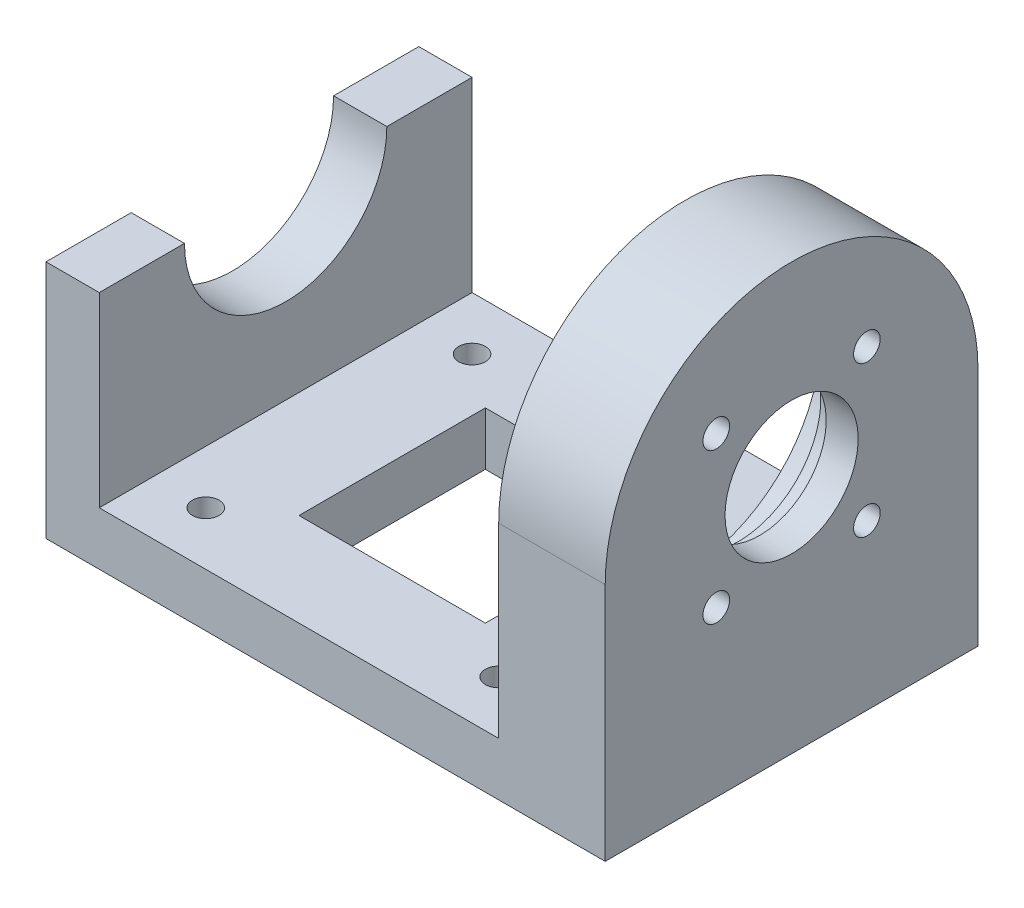
ISO-10303-21;
HEADER;
FILE_DESCRIPTION(('STEP AP214'),'2;1');
FILE_NAME('part.step','',(''),(''),'','','');
FILE_SCHEMA(('AUTOMOTIVE_DESIGN { 1 0 10303 214 1 1 1 1 }'));
ENDSEC;
DATA;
#1=APPLICATION_CONTEXT('core data for automotive mechanical design processes');
#2=APPLICATION_PROTOCOL_DEFINITION('international standard','automotive_design',2000,#1);
#3=PRODUCT_CONTEXT('',#1,'mechanical');
#4=PRODUCT('Part','Part','',(#3));
#5=PRODUCT_RELATED_PRODUCT_CATEGORY('part','',(#4));
#6=PRODUCT_DEFINITION_FORMATION('','',#4);
#7=PRODUCT_DEFINITION_CONTEXT('part definition',#1,'design');
#8=PRODUCT_DEFINITION('design','',#6,#7);
#9=PRODUCT_DEFINITION_SHAPE('','',#8);
#10=(LENGTH_UNIT() NAMED_UNIT(*) SI_UNIT(.MILLI.,.METRE.));
#11=(NAMED_UNIT(*) PLANE_ANGLE_UNIT() SI_UNIT($,.RADIAN.));
#12=(NAMED_UNIT(*) SI_UNIT($,.STERADIAN.) SOLID_ANGLE_UNIT());
#13=UNCERTAINTY_MEASURE_WITH_UNIT(LENGTH_MEASURE(1.E-05),#10,'distance_accuracy_value','');
#14=(GEOMETRIC_REPRESENTATION_CONTEXT(3) GLOBAL_UNCERTAINTY_ASSIGNED_CONTEXT((#13)) GLOBAL_UNIT_ASSIGNED_CONTEXT((#10,
#11,#12)) REPRESENTATION_CONTEXT('',''));
#15=CARTESIAN_POINT('',(0.,0.,0.));
#16=DIRECTION('',(0.,0.,1.));
#17=DIRECTION('',(1.,0.,0.));
#18=AXIS2_PLACEMENT_3D('',#15,#16,#17);
#19=CARTESIAN_POINT('',(0.,45.,0.));
#20=DIRECTION('',(0.,1.,0.));
#21=DIRECTION('',(0.,0.,1.));
#22=AXIS2_PLACEMENT_3D('',#19,#20,#21);
#23=PLANE('',#22);
#24=DIRECTION('',(-1.,0.,0.));
#25=VECTOR('',#24,1.);
#26=CARTESIAN_POINT('',(-42.5,45.,-19.));
#27=LINE('',#26,#25);
#28=CARTESIAN_POINT('',(-42.5,45.,-19.));
#29=VERTEX_POINT('',#28);
#30=CARTESIAN_POINT('',(-52.5,45.,-19.));
#31=VERTEX_POINT('',#30);
#32=EDGE_CURVE('E11',#29,#31,#27,.T.);
#33=ORIENTED_EDGE('',*,*,#32,.F.);
#34=DIRECTION('',(0.,0.,-1.));
#35=VECTOR('',#34,1.);
#36=CARTESIAN_POINT('',(-42.5,45.,-35.));
#37=LINE('',#36,#35);
#38=CARTESIAN_POINT('',(-42.5,45.,-35.));
#39=VERTEX_POINT('',#38);
#40=EDGE_CURVE('E212',#29,#39,#37,.T.);
#41=ORIENTED_EDGE('',*,*,#40,.T.);
#42=DIRECTION('',(-1.,0.,0.));
#43=VECTOR('',#42,1.);
#44=CARTESIAN_POINT('',(-52.5,45.,-35.));
#45=LINE('',#44,#43);
#46=CARTESIAN_POINT('',(-52.5,45.,-35.));
#47=VERTEX_POINT('',#46);
#48=EDGE_CURVE('E216',#39,#47,#45,.T.);
#49=ORIENTED_EDGE('',*,*,#48,.T.);
#50=DIRECTION('',(0.,0.,1.));
#51=VECTOR('',#50,1.);
#52=CARTESIAN_POINT('',(-52.5,45.,-35.));
#53=LINE('',#52,#51);
#54=EDGE_CURVE('E206',#47,#31,#53,.T.);
#55=ORIENTED_EDGE('',*,*,#54,.T.);
#56=EDGE_LOOP('',(#33,#41,#49,#55));
#57=FACE_BOUND('',#56,.T.);
#58=ADVANCED_FACE('F34',(#57),#23,.T.);
#59=CARTESIAN_POINT('',(0.,10.,0.));
#60=DIRECTION('',(0.,-1.,0.));
#61=DIRECTION('',(0.,0.,-1.));
#62=AXIS2_PLACEMENT_3D('',#59,#60,#61);
#63=PLANE('',#62);
#64=DIRECTION('',(-1.,0.,0.));
#65=VECTOR('',#64,1.);
#66=CARTESIAN_POINT('',(-22.5,10.,-17.5));
#67=LINE('',#66,#65);
#68=CARTESIAN_POINT('',(12.5,10.,-17.5));
#69=VERTEX_POINT('',#68);
#70=CARTESIAN_POINT('',(-22.5,10.,-17.5));
#71=VERTEX_POINT('',#70);
#72=EDGE_CURVE('E161',#69,#71,#67,.T.);
#73=ORIENTED_EDGE('',*,*,#72,.F.);
#74=DIRECTION('',(0.,0.,-1.));
#75=VECTOR('',#74,1.);
#76=CARTESIAN_POINT('',(12.5,10.,17.5));
#77=LINE('',#76,#75);
#78=CARTESIAN_POINT('',(12.5,10.,17.5));
#79=VERTEX_POINT('',#78);
#80=EDGE_CURVE('E49',#79,#69,#77,.T.);
#81=ORIENTED_EDGE('',*,*,#80,.F.);
#82=DIRECTION('',(1.,0.,0.));
#83=VECTOR('',#82,1.);
#84=CARTESIAN_POINT('',(-22.5,10.,17.5));
#85=LINE('',#84,#83);
#86=CARTESIAN_POINT('',(-22.5,10.,17.5));
#87=VERTEX_POINT('',#86);
#88=EDGE_CURVE('E152',#87,#79,#85,.T.);
#89=ORIENTED_EDGE('',*,*,#88,.F.);
#90=DIRECTION('',(0.,0.,1.));
#91=VECTOR('',#90,1.);
#92=CARTESIAN_POINT('',(-22.5,10.,17.5));
#93=LINE('',#92,#91);
#94=EDGE_CURVE('E155',#71,#87,#93,.T.);
#95=ORIENTED_EDGE('',*,*,#94,.F.);
#96=EDGE_LOOP('',(#73,#81,#89,#95));
#97=FACE_BOUND('',#96,.T.);
#98=CARTESIAN_POINT('',(22.5,10.,-25.));
#99=DIRECTION('',(0.,1.,0.));
#100=DIRECTION('',(0.,0.,1.));
#101=AXIS2_PLACEMENT_3D('',#98,#99,#100);
#102=CIRCLE('',#101,2.5);
#103=CARTESIAN_POINT('',(22.5,10.,-22.5));
#104=VERTEX_POINT('',#103);
#105=EDGE_CURVE('E181',#104,#104,#102,.T.);
#106=ORIENTED_EDGE('',*,*,#105,.F.);
#107=EDGE_LOOP('',(#106));
#108=FACE_BOUND('',#107,.T.);
#109=CARTESIAN_POINT('',(22.5,10.,25.));
#110=DIRECTION('',(0.,1.,0.));
#111=DIRECTION('',(0.,0.,1.));
#112=AXIS2_PLACEMENT_3D('',#109,#110,#111);
#113=CIRCLE('',#112,2.5);
#114=CARTESIAN_POINT('',(22.5,10.,27.5));
#115=VERTEX_POINT('',#114);
#116=EDGE_CURVE('E187',#115,#115,#113,.T.);
#117=ORIENTED_EDGE('',*,*,#116,.F.);
#118=EDGE_LOOP('',(#117));
#119=FACE_BOUND('',#118,.T.);
#120=CARTESIAN_POINT('',(-32.5,10.,25.));
#121=DIRECTION('',(0.,1.,0.));
#122=DIRECTION('',(0.,0.,1.));
#123=AXIS2_PLACEMENT_3D('',#120,#121,#122);
#124=CIRCLE('',#123,2.5);
#125=CARTESIAN_POINT('',(-32.5,10.,27.5));
#126=VERTEX_POINT('',#125);
#127=EDGE_CURVE('E176',#126,#126,#124,.T.);
#128=ORIENTED_EDGE('',*,*,#127,.F.);
#129=EDGE_LOOP('',(#128));
#130=FACE_BOUND('',#129,.T.);
#131=CARTESIAN_POINT('',(-32.5,10.,-25.));
#132=DIRECTION('',(0.,1.,0.));
#133=DIRECTION('',(0.,0.,1.));
#134=AXIS2_PLACEMENT_3D('',#131,#132,#133);
#135=CIRCLE('',#134,2.5);
#136=CARTESIAN_POINT('',(-32.5,10.,-22.5));
#137=VERTEX_POINT('',#136);
#138=EDGE_CURVE('E180',#137,#137,#135,.T.);
#139=ORIENTED_EDGE('',*,*,#138,.F.);
#140=EDGE_LOOP('',(#139));
#141=FACE_BOUND('',#140,.T.);
#142=DIRECTION('',(0.,0.,-1.));
#143=VECTOR('',#142,1.);
#144=CARTESIAN_POINT('',(-42.5,10.,-35.));
#145=LINE('',#144,#143);
#146=CARTESIAN_POINT('',(-42.5,10.,35.));
#147=VERTEX_POINT('',#146);
#148=CARTESIAN_POINT('',(-42.5,10.,-35.));
#149=VERTEX_POINT('',#148);
#150=EDGE_CURVE('E204',#147,#149,#145,.T.);
#151=ORIENTED_EDGE('',*,*,#150,.F.);
#152=DIRECTION('',(1.,0.,0.));
#153=VECTOR('',#152,1.);
#154=CARTESIAN_POINT('',(-52.5,10.,35.));
#155=LINE('',#154,#153);
#156=CARTESIAN_POINT('',(32.5,10.,35.));
#157=VERTEX_POINT('',#156);
#158=EDGE_CURVE('E284',#147,#157,#155,.T.);
#159=ORIENTED_EDGE('',*,*,#158,.T.);
#160=DIRECTION('',(0.,0.,1.));
#161=VECTOR('',#160,1.);
#162=CARTESIAN_POINT('',(32.5,10.,-35.));
#163=LINE('',#162,#161);
#164=CARTESIAN_POINT('',(32.5,10.,-35.));
#165=VERTEX_POINT('',#164);
#166=EDGE_CURVE('E273',#165,#157,#163,.T.);
#167=ORIENTED_EDGE('',*,*,#166,.F.);
#168=DIRECTION('',(-1.,0.,0.));
#169=VECTOR('',#168,1.);
#170=CARTESIAN_POINT('',(-52.5,10.,-35.));
#171=LINE('',#170,#169);
#172=EDGE_CURVE('E282',#165,#149,#171,.T.);
#173=ORIENTED_EDGE('',*,*,#172,.T.);
#174=EDGE_LOOP('',(#151,#159,#167,#173));
#175=FACE_BOUND('',#174,.T.);
#176=ADVANCED_FACE('F348',(#97,#108,#119,#130,#141,#175),#63,.F.);
#177=CARTESIAN_POINT('',(52.5,10.,35.));
#178=DIRECTION('',(-1.,0.,0.));
#179=DIRECTION('',(0.,0.,1.));
#180=AXIS2_PLACEMENT_3D('',#177,#178,#179);
#181=PLANE('',#180);
#182=CARTESIAN_POINT('',(52.5,45.,0.));
#183=DIRECTION('',(-1.,0.,0.));
#184=DIRECTION('',(0.,0.,1.));
#185=AXIS2_PLACEMENT_3D('',#182,#183,#184);
#186=CIRCLE('',#185,12.5);
#187=CARTESIAN_POINT('',(52.5,45.,12.5));
#188=VERTEX_POINT('',#187);
#189=EDGE_CURVE('E173',#188,#188,#186,.T.);
#190=ORIENTED_EDGE('',*,*,#189,.T.);
#191=EDGE_LOOP('',(#190));
#192=FACE_BOUND('',#191,.T.);
#193=CARTESIAN_POINT('',(52.5,30.857864376269,14.1421356237313));
#194=DIRECTION('',(-1.,0.,0.));
#195=DIRECTION('',(0.,0.,1.));
#196=AXIS2_PLACEMENT_3D('',#193,#194,#195);
#197=CIRCLE('',#196,2.5);
#198=CARTESIAN_POINT('',(52.5,30.857864376269,16.6421356237313));
#199=VERTEX_POINT('',#198);
#200=EDGE_CURVE('E231',#199,#199,#197,.F.);
#201=ORIENTED_EDGE('',*,*,#200,.F.);
#202=EDGE_LOOP('',(#201));
#203=FACE_BOUND('',#202,.T.);
#204=CARTESIAN_POINT('',(52.5,30.8578643762688,-14.1421356237307));
#205=DIRECTION('',(-1.,0.,0.));
#206=DIRECTION('',(0.,0.,1.));
#207=AXIS2_PLACEMENT_3D('',#204,#205,#206);
#208=CIRCLE('',#207,2.5);
#209=CARTESIAN_POINT('',(52.5,30.8578643762688,-11.6421356237307));
#210=VERTEX_POINT('',#209);
#211=EDGE_CURVE('E232',#210,#210,#208,.F.);
#212=ORIENTED_EDGE('',*,*,#211,.F.);
#213=EDGE_LOOP('',(#212));
#214=FACE_BOUND('',#213,.T.);
#215=CARTESIAN_POINT('',(52.5,59.1421356237307,-14.1421356237308));
#216=DIRECTION('',(-1.,0.,0.));
#217=DIRECTION('',(0.,0.,1.));
#218=AXIS2_PLACEMENT_3D('',#215,#216,#217);
#219=CIRCLE('',#218,2.5);
#220=CARTESIAN_POINT('',(52.5,59.1421356237307,-11.6421356237308));
#221=VERTEX_POINT('',#220);
#222=EDGE_CURVE('E239',#221,#221,#219,.F.);
#223=ORIENTED_EDGE('',*,*,#222,.F.);
#224=EDGE_LOOP('',(#223));
#225=FACE_BOUND('',#224,.T.);
#226=CARTESIAN_POINT('',(52.5,59.1421356237309,14.142135623731));
#227=DIRECTION('',(-1.,0.,0.));
#228=DIRECTION('',(0.,0.,1.));
#229=AXIS2_PLACEMENT_3D('',#226,#227,#228);
#230=CIRCLE('',#229,2.5);
#231=CARTESIAN_POINT('',(52.5,59.1421356237309,16.642135623731));
#232=VERTEX_POINT('',#231);
#233=EDGE_CURVE('E248',#232,#232,#230,.F.);
#234=ORIENTED_EDGE('',*,*,#233,.F.);
#235=EDGE_LOOP('',(#234));
#236=FACE_BOUND('',#235,.T.);
#237=CARTESIAN_POINT('',(52.5,45.,0.));
#238=DIRECTION('',(-1.,0.,0.));
#239=DIRECTION('',(0.,0.,1.));
#240=AXIS2_PLACEMENT_3D('',#237,#238,#239);
#241=CIRCLE('',#240,35.);
#242=CARTESIAN_POINT('',(52.5,45.,35.));
#243=VERTEX_POINT('',#242);
#244=CARTESIAN_POINT('',(52.5,45.,-35.));
#245=VERTEX_POINT('',#244);
#246=EDGE_CURVE('E267',#243,#245,#241,.T.);
#247=ORIENTED_EDGE('',*,*,#246,.F.);
#248=DIRECTION('',(0.,-1.,0.));
#249=VECTOR('',#248,1.);
#250=CARTESIAN_POINT('',(52.5,10.,35.));
#251=LINE('',#250,#249);
#252=CARTESIAN_POINT('',(52.5,0.,35.));
#253=VERTEX_POINT('',#252);
#254=EDGE_CURVE('E287',#243,#253,#251,.T.);
#255=ORIENTED_EDGE('',*,*,#254,.T.);
#256=DIRECTION('',(0.,0.,-1.));
#257=VECTOR('',#256,1.);
#258=CARTESIAN_POINT('',(52.5,0.,35.));
#259=LINE('',#258,#257);
#260=CARTESIAN_POINT('',(52.5,0.,-35.));
#261=VERTEX_POINT('',#260);
#262=EDGE_CURVE('E281',#253,#261,#259,.T.);
#263=ORIENTED_EDGE('',*,*,#262,.T.);
#264=DIRECTION('',(0.,-1.,0.));
#265=VECTOR('',#264,1.);
#266=CARTESIAN_POINT('',(52.5,10.,-35.));
#267=LINE('',#266,#265);
#268=EDGE_CURVE('E303',#245,#261,#267,.T.);
#269=ORIENTED_EDGE('',*,*,#268,.F.);
#270=EDGE_LOOP('',(#247,#255,#263,#269));
#271=FACE_BOUND('',#270,.T.);
#272=ADVANCED_FACE('F36',(#192,#203,#214,#225,#236,#271),#181,.F.);
#273=CARTESIAN_POINT('',(32.5,80.,-35.));
#274=DIRECTION('',(1.,0.,0.));
#275=DIRECTION('',(0.,0.,-1.));
#276=AXIS2_PLACEMENT_3D('',#273,#274,#275);
#277=PLANE('',#276);
#278=CARTESIAN_POINT('',(32.5,45.,0.));
#279=DIRECTION('',(-1.,0.,0.));
#280=DIRECTION('',(0.,0.,1.));
#281=AXIS2_PLACEMENT_3D('',#278,#279,#280);
#282=CIRCLE('',#281,25.5);
#283=CARTESIAN_POINT('',(32.5,45.,25.5));
#284=VERTEX_POINT('',#283);
#285=EDGE_CURVE('E255',#284,#284,#282,.T.);
#286=ORIENTED_EDGE('',*,*,#285,.F.);
#287=EDGE_LOOP('',(#286));
#288=FACE_BOUND('',#287,.T.);
#289=DIRECTION('',(0.,-1.,0.));
#290=VECTOR('',#289,1.);
#291=CARTESIAN_POINT('',(32.5,80.,35.));
#292=LINE('',#291,#290);
#293=CARTESIAN_POINT('',(32.5,45.,35.));
#294=VERTEX_POINT('',#293);
#295=EDGE_CURVE('E276',#294,#157,#292,.T.);
#296=ORIENTED_EDGE('',*,*,#295,.F.);
#297=CARTESIAN_POINT('',(32.5,45.,0.));
#298=DIRECTION('',(-1.,0.,0.));
#299=DIRECTION('',(0.,0.,1.));
#300=AXIS2_PLACEMENT_3D('',#297,#298,#299);
#301=CIRCLE('',#300,35.);
#302=CARTESIAN_POINT('',(32.5,45.,-35.));
#303=VERTEX_POINT('',#302);
#304=EDGE_CURVE('E266',#294,#303,#301,.T.);
#305=ORIENTED_EDGE('',*,*,#304,.T.);
#306=DIRECTION('',(0.,-1.,0.));
#307=VECTOR('',#306,1.);
#308=CARTESIAN_POINT('',(32.5,80.,-35.));
#309=LINE('',#308,#307);
#310=EDGE_CURVE('E279',#303,#165,#309,.T.);
#311=ORIENTED_EDGE('',*,*,#310,.T.);
#312=ORIENTED_EDGE('',*,*,#166,.T.);
#313=EDGE_LOOP('',(#296,#305,#311,#312));
#314=FACE_BOUND('',#313,.T.);
#315=ADVANCED_FACE('F346',(#288,#314),#277,.F.);
#316=CARTESIAN_POINT('',(-52.5,10.,-35.));
#317=DIRECTION('',(0.,0.,1.));
#318=DIRECTION('',(1.,0.,0.));
#319=AXIS2_PLACEMENT_3D('',#316,#317,#318);
#320=PLANE('',#319);
#321=DIRECTION('',(-1.,0.,0.));
#322=VECTOR('',#321,1.);
#323=CARTESIAN_POINT('',(52.5,45.,-35.));
#324=LINE('',#323,#322);
#325=EDGE_CURVE('E269',#245,#303,#324,.T.);
#326=ORIENTED_EDGE('',*,*,#325,.F.);
#327=ORIENTED_EDGE('',*,*,#268,.T.);
#328=DIRECTION('',(-1.,0.,0.));
#329=VECTOR('',#328,1.);
#330=CARTESIAN_POINT('',(-52.5,0.,-35.));
#331=LINE('',#330,#329);
#332=CARTESIAN_POINT('',(-52.5,0.,-35.));
#333=VERTEX_POINT('',#332);
#334=EDGE_CURVE('E290',#261,#333,#331,.T.);
#335=ORIENTED_EDGE('',*,*,#334,.T.);
#336=DIRECTION('',(0.,-1.,0.));
#337=VECTOR('',#336,1.);
#338=CARTESIAN_POINT('',(-52.5,10.,-35.));
#339=LINE('',#338,#337);
#340=EDGE_CURVE('E300',#47,#333,#339,.T.);
#341=ORIENTED_EDGE('',*,*,#340,.F.);
#342=ORIENTED_EDGE('',*,*,#48,.F.);
#343=DIRECTION('',(0.,-1.,0.));
#344=VECTOR('',#343,1.);
#345=CARTESIAN_POINT('',(-42.5,45.,-35.));
#346=LINE('',#345,#344);
#347=EDGE_CURVE('E219',#39,#149,#346,.T.);
#348=ORIENTED_EDGE('',*,*,#347,.T.);
#349=ORIENTED_EDGE('',*,*,#172,.F.);
#350=ORIENTED_EDGE('',*,*,#310,.F.);
#351=EDGE_LOOP('',(#326,#327,#335,#341,#342,#348,#349,#350));
#352=FACE_BOUND('',#351,.T.);
#353=ADVANCED_FACE('F329',(#352),#320,.F.);
#354=CARTESIAN_POINT('',(-52.5,10.,35.));
#355=DIRECTION('',(1.,0.,0.));
#356=DIRECTION('',(0.,0.,-1.));
#357=AXIS2_PLACEMENT_3D('',#354,#355,#356);
#358=PLANE('',#357);
#359=CARTESIAN_POINT('',(-52.5,45.,19.));
#360=VERTEX_POINT('',#359);
#361=CARTESIAN_POINT('',(-52.5,45.,35.));
#362=VERTEX_POINT('',#361);
#363=EDGE_CURVE('E210',#360,#362,#53,.T.);
#364=ORIENTED_EDGE('',*,*,#363,.F.);
#365=CARTESIAN_POINT('',(-52.5,45.,0.));
#366=DIRECTION('',(-1.,0.,0.));
#367=DIRECTION('',(0.,0.,1.));
#368=AXIS2_PLACEMENT_3D('',#365,#366,#367);
#369=CIRCLE('',#368,19.);
#370=EDGE_CURVE('E198',#31,#360,#369,.T.);
#371=ORIENTED_EDGE('',*,*,#370,.F.);
#372=ORIENTED_EDGE('',*,*,#54,.F.);
#373=ORIENTED_EDGE('',*,*,#340,.T.);
#374=DIRECTION('',(0.,0.,1.));
#375=VECTOR('',#374,1.);
#376=CARTESIAN_POINT('',(-52.5,0.,35.));
#377=LINE('',#376,#375);
#378=CARTESIAN_POINT('',(-52.5,0.,35.));
#379=VERTEX_POINT('',#378);
#380=EDGE_CURVE('E292',#333,#379,#377,.T.);
#381=ORIENTED_EDGE('',*,*,#380,.T.);
#382=DIRECTION('',(0.,-1.,0.));
#383=VECTOR('',#382,1.);
#384=CARTESIAN_POINT('',(-52.5,10.,35.));
#385=LINE('',#384,#383);
#386=EDGE_CURVE('E297',#362,#379,#385,.T.);
#387=ORIENTED_EDGE('',*,*,#386,.F.);
#388=EDGE_LOOP('',(#364,#371,#372,#373,#381,#387));
#389=FACE_BOUND('',#388,.T.);
#390=ADVANCED_FACE('F334',(#389),#358,.F.);
#391=CARTESIAN_POINT('',(-52.5,10.,35.));
#392=DIRECTION('',(0.,0.,-1.));
#393=DIRECTION('',(-1.,0.,0.));
#394=AXIS2_PLACEMENT_3D('',#391,#392,#393);
#395=PLANE('',#394);
#396=ORIENTED_EDGE('',*,*,#254,.F.);
#397=DIRECTION('',(-1.,0.,0.));
#398=VECTOR('',#397,1.);
#399=CARTESIAN_POINT('',(52.5,45.,35.));
#400=LINE('',#399,#398);
#401=EDGE_CURVE('E261',#243,#294,#400,.T.);
#402=ORIENTED_EDGE('',*,*,#401,.T.);
#403=ORIENTED_EDGE('',*,*,#295,.T.);
#404=ORIENTED_EDGE('',*,*,#158,.F.);
#405=DIRECTION('',(0.,-1.,0.));
#406=VECTOR('',#405,1.);
#407=CARTESIAN_POINT('',(-42.5,45.,35.));
#408=LINE('',#407,#406);
#409=CARTESIAN_POINT('',(-42.5,45.,35.));
#410=VERTEX_POINT('',#409);
#411=EDGE_CURVE('E224',#410,#147,#408,.T.);
#412=ORIENTED_EDGE('',*,*,#411,.F.);
#413=DIRECTION('',(1.,0.,0.));
#414=VECTOR('',#413,1.);
#415=CARTESIAN_POINT('',(-52.5,45.,35.));
#416=LINE('',#415,#414);
#417=EDGE_CURVE('E209',#362,#410,#416,.T.);
#418=ORIENTED_EDGE('',*,*,#417,.F.);
#419=ORIENTED_EDGE('',*,*,#386,.T.);
#420=DIRECTION('',(1.,0.,0.));
#421=VECTOR('',#420,1.);
#422=CARTESIAN_POINT('',(-52.5,0.,35.));
#423=LINE('',#422,#421);
#424=EDGE_CURVE('E285',#379,#253,#423,.T.);
#425=ORIENTED_EDGE('',*,*,#424,.T.);
#426=EDGE_LOOP('',(#396,#402,#403,#404,#412,#418,#419,#425));
#427=FACE_BOUND('',#426,.T.);
#428=ADVANCED_FACE('F322',(#427),#395,.F.);
#429=CARTESIAN_POINT('',(0.,0.,0.));
#430=DIRECTION('',(0.,-1.,0.));
#431=DIRECTION('',(0.,0.,-1.));
#432=AXIS2_PLACEMENT_3D('',#429,#430,#431);
#433=PLANE('',#432);
#434=DIRECTION('',(0.,0.,-1.));
#435=VECTOR('',#434,1.);
#436=CARTESIAN_POINT('',(12.5,0.,17.5));
#437=LINE('',#436,#435);
#438=CARTESIAN_POINT('',(12.5,0.,17.5));
#439=VERTEX_POINT('',#438);
#440=CARTESIAN_POINT('',(12.5,0.,-17.5));
#441=VERTEX_POINT('',#440);
#442=EDGE_CURVE('E136',#439,#441,#437,.T.);
#443=ORIENTED_EDGE('',*,*,#442,.T.);
#444=DIRECTION('',(-1.,0.,0.));
#445=VECTOR('',#444,1.);
#446=CARTESIAN_POINT('',(-22.5,0.,-17.5));
#447=LINE('',#446,#445);
#448=CARTESIAN_POINT('',(-22.5,0.,-17.5));
#449=VERTEX_POINT('',#448);
#450=EDGE_CURVE('E145',#441,#449,#447,.T.);
#451=ORIENTED_EDGE('',*,*,#450,.T.);
#452=DIRECTION('',(0.,0.,1.));
#453=VECTOR('',#452,1.);
#454=CARTESIAN_POINT('',(-22.5,0.,17.5));
#455=LINE('',#454,#453);
#456=CARTESIAN_POINT('',(-22.5,0.,17.5));
#457=VERTEX_POINT('',#456);
#458=EDGE_CURVE('E57',#449,#457,#455,.T.);
#459=ORIENTED_EDGE('',*,*,#458,.T.);
#460=DIRECTION('',(1.,0.,0.));
#461=VECTOR('',#460,1.);
#462=CARTESIAN_POINT('',(-22.5,0.,17.5));
#463=LINE('',#462,#461);
#464=EDGE_CURVE('E142',#457,#439,#463,.T.);
#465=ORIENTED_EDGE('',*,*,#464,.T.);
#466=EDGE_LOOP('',(#443,#451,#459,#465));
#467=FACE_BOUND('',#466,.T.);
#468=CARTESIAN_POINT('',(22.5,0.,-25.));
#469=DIRECTION('',(0.,1.,0.));
#470=DIRECTION('',(0.,0.,1.));
#471=AXIS2_PLACEMENT_3D('',#468,#469,#470);
#472=CIRCLE('',#471,2.5);
#473=CARTESIAN_POINT('',(22.5,0.,-22.5));
#474=VERTEX_POINT('',#473);
#475=EDGE_CURVE('E177',#474,#474,#472,.T.);
#476=ORIENTED_EDGE('',*,*,#475,.T.);
#477=EDGE_LOOP('',(#476));
#478=FACE_BOUND('',#477,.T.);
#479=CARTESIAN_POINT('',(22.5,0.,25.));
#480=DIRECTION('',(0.,1.,0.));
#481=DIRECTION('',(0.,0.,1.));
#482=AXIS2_PLACEMENT_3D('',#479,#480,#481);
#483=CIRCLE('',#482,2.5);
#484=CARTESIAN_POINT('',(22.5,0.,27.5));
#485=VERTEX_POINT('',#484);
#486=EDGE_CURVE('E184',#485,#485,#483,.T.);
#487=ORIENTED_EDGE('',*,*,#486,.T.);
#488=EDGE_LOOP('',(#487));
#489=FACE_BOUND('',#488,.T.);
#490=CARTESIAN_POINT('',(-32.5,0.,25.));
#491=DIRECTION('',(0.,1.,0.));
#492=DIRECTION('',(0.,0.,1.));
#493=AXIS2_PLACEMENT_3D('',#490,#491,#492);
#494=CIRCLE('',#493,2.5);
#495=CARTESIAN_POINT('',(-32.5,0.,27.5));
#496=VERTEX_POINT('',#495);
#497=EDGE_CURVE('E190',#496,#496,#494,.T.);
#498=ORIENTED_EDGE('',*,*,#497,.T.);
#499=EDGE_LOOP('',(#498));
#500=FACE_BOUND('',#499,.T.);
#501=CARTESIAN_POINT('',(-32.5,0.,-25.));
#502=DIRECTION('',(0.,1.,0.));
#503=DIRECTION('',(0.,0.,1.));
#504=AXIS2_PLACEMENT_3D('',#501,#502,#503);
#505=CIRCLE('',#504,2.5);
#506=CARTESIAN_POINT('',(-32.5,0.,-22.5));
#507=VERTEX_POINT('',#506);
#508=EDGE_CURVE('E195',#507,#507,#505,.T.);
#509=ORIENTED_EDGE('',*,*,#508,.T.);
#510=EDGE_LOOP('',(#509));
#511=FACE_BOUND('',#510,.T.);
#512=ORIENTED_EDGE('',*,*,#262,.F.);
#513=ORIENTED_EDGE('',*,*,#424,.F.);
#514=ORIENTED_EDGE('',*,*,#380,.F.);
#515=ORIENTED_EDGE('',*,*,#334,.F.);
#516=EDGE_LOOP('',(#512,#513,#514,#515));
#517=FACE_BOUND('',#516,.T.);
#518=ADVANCED_FACE('F149',(#467,#478,#489,#500,#511,#517),#433,.T.);
#519=CARTESIAN_POINT('',(52.5,45.,0.));
#520=DIRECTION('',(-1.,0.,0.));
#521=DIRECTION('',(0.,0.,1.));
#522=AXIS2_PLACEMENT_3D('',#519,#520,#521);
#523=CYLINDRICAL_SURFACE('',#522,35.);
#524=ORIENTED_EDGE('',*,*,#304,.F.);
#525=ORIENTED_EDGE('',*,*,#401,.F.);
#526=ORIENTED_EDGE('',*,*,#246,.T.);
#527=ORIENTED_EDGE('',*,*,#325,.T.);
#528=EDGE_LOOP('',(#524,#525,#526,#527));
#529=FACE_BOUND('',#528,.T.);
#530=ADVANCED_FACE('F364',(#529),#523,.T.);
#531=CARTESIAN_POINT('',(42.5,45.,0.));
#532=DIRECTION('',(-1.,0.,0.));
#533=DIRECTION('',(0.,0.,1.));
#534=AXIS2_PLACEMENT_3D('',#531,#532,#533);
#535=CYLINDRICAL_SURFACE('',#534,25.5);
#536=CARTESIAN_POINT('',(42.5,45.,0.));
#537=DIRECTION('',(-1.,0.,0.));
#538=DIRECTION('',(0.,0.,1.));
#539=AXIS2_PLACEMENT_3D('',#536,#537,#538);
#540=CIRCLE('',#539,25.5);
#541=CARTESIAN_POINT('',(42.5,45.,25.5));
#542=VERTEX_POINT('',#541);
#543=EDGE_CURVE('E258',#542,#542,#540,.T.);
#544=ORIENTED_EDGE('',*,*,#543,.F.);
#545=EDGE_LOOP('',(#544));
#546=FACE_BOUND('',#545,.T.);
#547=ORIENTED_EDGE('',*,*,#285,.T.);
#548=EDGE_LOOP('',(#547));
#549=FACE_BOUND('',#548,.T.);
#550=ADVANCED_FACE('F377',(#546,#549),#535,.F.);
#551=CARTESIAN_POINT('',(42.5,45.,0.));
#552=DIRECTION('',(-1.,0.,0.));
#553=DIRECTION('',(0.,0.,1.));
#554=AXIS2_PLACEMENT_3D('',#551,#552,#553);
#555=PLANE('',#554);
#556=CARTESIAN_POINT('',(42.5,30.857864376269,14.1421356237313));
#557=DIRECTION('',(-1.,0.,0.));
#558=DIRECTION('',(0.,0.,1.));
#559=AXIS2_PLACEMENT_3D('',#556,#557,#558);
#560=CIRCLE('',#559,2.5);
#561=CARTESIAN_POINT('',(42.5,30.857864376269,16.6421356237313));
#562=VERTEX_POINT('',#561);
#563=EDGE_CURVE('E228',#562,#562,#560,.T.);
#564=ORIENTED_EDGE('',*,*,#563,.F.);
#565=EDGE_LOOP('',(#564));
#566=FACE_BOUND('',#565,.T.);
#567=CARTESIAN_POINT('',(42.5,30.8578643762688,-14.1421356237307));
#568=DIRECTION('',(-1.,0.,0.));
#569=DIRECTION('',(0.,0.,1.));
#570=AXIS2_PLACEMENT_3D('',#567,#568,#569);
#571=CIRCLE('',#570,2.5);
#572=CARTESIAN_POINT('',(42.5,30.8578643762688,-11.6421356237307));
#573=VERTEX_POINT('',#572);
#574=EDGE_CURVE('E236',#573,#573,#571,.T.);
#575=ORIENTED_EDGE('',*,*,#574,.F.);
#576=EDGE_LOOP('',(#575));
#577=FACE_BOUND('',#576,.T.);
#578=CARTESIAN_POINT('',(42.5,59.1421356237307,-14.1421356237308));
#579=DIRECTION('',(-1.,0.,0.));
#580=DIRECTION('',(0.,0.,1.));
#581=AXIS2_PLACEMENT_3D('',#578,#579,#580);
#582=CIRCLE('',#581,2.5);
#583=CARTESIAN_POINT('',(42.5,59.1421356237307,-11.6421356237308));
#584=VERTEX_POINT('',#583);
#585=EDGE_CURVE('E227',#584,#584,#582,.T.);
#586=ORIENTED_EDGE('',*,*,#585,.F.);
#587=EDGE_LOOP('',(#586));
#588=FACE_BOUND('',#587,.T.);
#589=CARTESIAN_POINT('',(42.5,59.1421356237309,14.142135623731));
#590=DIRECTION('',(-1.,0.,0.));
#591=DIRECTION('',(0.,0.,1.));
#592=AXIS2_PLACEMENT_3D('',#589,#590,#591);
#593=CIRCLE('',#592,2.5);
#594=CARTESIAN_POINT('',(42.5,59.1421356237309,16.642135623731));
#595=VERTEX_POINT('',#594);
#596=EDGE_CURVE('E235',#595,#595,#593,.T.);
#597=ORIENTED_EDGE('',*,*,#596,.F.);
#598=EDGE_LOOP('',(#597));
#599=FACE_BOUND('',#598,.T.);
#600=CARTESIAN_POINT('',(42.5,45.,0.));
#601=DIRECTION('',(-1.,0.,0.));
#602=DIRECTION('',(0.,0.,1.));
#603=AXIS2_PLACEMENT_3D('',#600,#601,#602);
#604=CIRCLE('',#603,15.5);
#605=CARTESIAN_POINT('',(42.5,45.,15.5));
#606=VERTEX_POINT('',#605);
#607=EDGE_CURVE('E251',#606,#606,#604,.T.);
#608=ORIENTED_EDGE('',*,*,#607,.F.);
#609=EDGE_LOOP('',(#608));
#610=FACE_BOUND('',#609,.T.);
#611=ORIENTED_EDGE('',*,*,#543,.T.);
#612=EDGE_LOOP('',(#611));
#613=FACE_BOUND('',#612,.T.);
#614=ADVANCED_FACE('F379',(#566,#577,#588,#599,#610,#613),#555,.T.);
#615=CARTESIAN_POINT('',(46.5,45.,0.));
#616=DIRECTION('',(-1.,0.,0.));
#617=DIRECTION('',(0.,0.,1.));
#618=AXIS2_PLACEMENT_3D('',#615,#616,#617);
#619=CYLINDRICAL_SURFACE('',#618,15.5);
#620=CARTESIAN_POINT('',(46.5,45.,0.));
#621=DIRECTION('',(-1.,0.,0.));
#622=DIRECTION('',(0.,0.,1.));
#623=AXIS2_PLACEMENT_3D('',#620,#621,#622);
#624=CIRCLE('',#623,15.5);
#625=CARTESIAN_POINT('',(46.5,45.,15.5));
#626=VERTEX_POINT('',#625);
#627=EDGE_CURVE('E252',#626,#626,#624,.T.);
#628=ORIENTED_EDGE('',*,*,#627,.F.);
#629=EDGE_LOOP('',(#628));
#630=FACE_BOUND('',#629,.T.);
#631=ORIENTED_EDGE('',*,*,#607,.T.);
#632=EDGE_LOOP('',(#631));
#633=FACE_BOUND('',#632,.T.);
#634=ADVANCED_FACE('F386',(#630,#633),#619,.F.);
#635=CARTESIAN_POINT('',(46.5,45.,0.));
#636=DIRECTION('',(-1.,0.,0.));
#637=DIRECTION('',(0.,0.,1.));
#638=AXIS2_PLACEMENT_3D('',#635,#636,#637);
#639=PLANE('',#638);
#640=CARTESIAN_POINT('',(46.5,45.,0.));
#641=DIRECTION('',(-1.,0.,0.));
#642=DIRECTION('',(0.,0.,1.));
#643=AXIS2_PLACEMENT_3D('',#640,#641,#642);
#644=CIRCLE('',#643,12.5);
#645=CARTESIAN_POINT('',(46.5,45.,12.5));
#646=VERTEX_POINT('',#645);
#647=EDGE_CURVE('E167',#646,#646,#644,.T.);
#648=ORIENTED_EDGE('',*,*,#647,.F.);
#649=EDGE_LOOP('',(#648));
#650=FACE_BOUND('',#649,.T.);
#651=ORIENTED_EDGE('',*,*,#627,.T.);
#652=EDGE_LOOP('',(#651));
#653=FACE_BOUND('',#652,.T.);
#654=ADVANCED_FACE('F393',(#650,#653),#639,.T.);
#655=CARTESIAN_POINT('',(59.5710678118655,59.1421356237309,14.142135623731));
#656=DIRECTION('',(-1.,0.,0.));
#657=DIRECTION('',(0.,0.,1.));
#658=AXIS2_PLACEMENT_3D('',#655,#656,#657);
#659=CYLINDRICAL_SURFACE('',#658,2.5);
#660=ORIENTED_EDGE('',*,*,#233,.T.);
#661=EDGE_LOOP('',(#660));
#662=FACE_BOUND('',#661,.T.);
#663=ORIENTED_EDGE('',*,*,#596,.T.);
#664=EDGE_LOOP('',(#663));
#665=FACE_BOUND('',#664,.T.);
#666=ADVANCED_FACE('F397',(#662,#665),#659,.F.);
#667=CARTESIAN_POINT('',(59.5710678118655,59.1421356237307,-14.1421356237308));
#668=DIRECTION('',(-1.,0.,0.));
#669=DIRECTION('',(0.,0.,1.));
#670=AXIS2_PLACEMENT_3D('',#667,#668,#669);
#671=CYLINDRICAL_SURFACE('',#670,2.5);
#672=ORIENTED_EDGE('',*,*,#222,.T.);
#673=EDGE_LOOP('',(#672));
#674=FACE_BOUND('',#673,.T.);
#675=ORIENTED_EDGE('',*,*,#585,.T.);
#676=EDGE_LOOP('',(#675));
#677=FACE_BOUND('',#676,.T.);
#678=ADVANCED_FACE('F401',(#674,#677),#671,.F.);
#679=CARTESIAN_POINT('',(59.5710678118655,30.8578643762688,-14.1421356237307));
#680=DIRECTION('',(-1.,0.,0.));
#681=DIRECTION('',(0.,0.,1.));
#682=AXIS2_PLACEMENT_3D('',#679,#680,#681);
#683=CYLINDRICAL_SURFACE('',#682,2.5);
#684=ORIENTED_EDGE('',*,*,#211,.T.);
#685=EDGE_LOOP('',(#684));
#686=FACE_BOUND('',#685,.T.);
#687=ORIENTED_EDGE('',*,*,#574,.T.);
#688=EDGE_LOOP('',(#687));
#689=FACE_BOUND('',#688,.T.);
#690=ADVANCED_FACE('F405',(#686,#689),#683,.F.);
#691=CARTESIAN_POINT('',(59.5710678118655,30.857864376269,14.1421356237313));
#692=DIRECTION('',(-1.,0.,0.));
#693=DIRECTION('',(0.,0.,1.));
#694=AXIS2_PLACEMENT_3D('',#691,#692,#693);
#695=CYLINDRICAL_SURFACE('',#694,2.5);
#696=ORIENTED_EDGE('',*,*,#200,.T.);
#697=EDGE_LOOP('',(#696));
#698=FACE_BOUND('',#697,.T.);
#699=ORIENTED_EDGE('',*,*,#563,.T.);
#700=EDGE_LOOP('',(#699));
#701=FACE_BOUND('',#700,.T.);
#702=ADVANCED_FACE('F409',(#698,#701),#695,.F.);
#703=CARTESIAN_POINT('',(-42.5,45.,-35.));
#704=DIRECTION('',(-1.,0.,0.));
#705=DIRECTION('',(0.,0.,1.));
#706=AXIS2_PLACEMENT_3D('',#703,#704,#705);
#707=PLANE('',#706);
#708=ORIENTED_EDGE('',*,*,#40,.F.);
#709=CARTESIAN_POINT('',(-42.5,45.,0.));
#710=DIRECTION('',(-1.,0.,0.));
#711=DIRECTION('',(0.,0.,1.));
#712=AXIS2_PLACEMENT_3D('',#709,#710,#711);
#713=CIRCLE('',#712,19.);
#714=CARTESIAN_POINT('',(-42.5,45.,19.));
#715=VERTEX_POINT('',#714);
#716=EDGE_CURVE('E201',#29,#715,#713,.T.);
#717=ORIENTED_EDGE('',*,*,#716,.T.);
#718=EDGE_CURVE('E213',#410,#715,#37,.T.);
#719=ORIENTED_EDGE('',*,*,#718,.F.);
#720=ORIENTED_EDGE('',*,*,#411,.T.);
#721=ORIENTED_EDGE('',*,*,#150,.T.);
#722=ORIENTED_EDGE('',*,*,#347,.F.);
#723=EDGE_LOOP('',(#708,#717,#719,#720,#721,#722));
#724=FACE_BOUND('',#723,.T.);
#725=ADVANCED_FACE('F314',(#724),#707,.F.);
#726=DIRECTION('',(-1.,0.,0.));
#727=VECTOR('',#726,1.);
#728=CARTESIAN_POINT('',(-42.5,45.,19.));
#729=LINE('',#728,#727);
#730=EDGE_CURVE('E42',#360,#715,#729,.F.);
#731=ORIENTED_EDGE('',*,*,#730,.F.);
#732=ORIENTED_EDGE('',*,*,#363,.T.);
#733=ORIENTED_EDGE('',*,*,#417,.T.);
#734=ORIENTED_EDGE('',*,*,#718,.T.);
#735=EDGE_LOOP('',(#731,#732,#733,#734));
#736=FACE_BOUND('',#735,.T.);
#737=ADVANCED_FACE('F316',(#736),#23,.T.);
#738=CARTESIAN_POINT('',(-42.5,45.,0.));
#739=DIRECTION('',(-1.,0.,0.));
#740=DIRECTION('',(0.,0.,1.));
#741=AXIS2_PLACEMENT_3D('',#738,#739,#740);
#742=CYLINDRICAL_SURFACE('',#741,19.);
#743=ORIENTED_EDGE('',*,*,#32,.T.);
#744=ORIENTED_EDGE('',*,*,#370,.T.);
#745=ORIENTED_EDGE('',*,*,#730,.T.);
#746=ORIENTED_EDGE('',*,*,#716,.F.);
#747=EDGE_LOOP('',(#743,#744,#745,#746));
#748=FACE_BOUND('',#747,.T.);
#749=ADVANCED_FACE('F306',(#748),#742,.F.);
#750=CARTESIAN_POINT('',(-32.5,0.,-25.));
#751=DIRECTION('',(0.,1.,0.));
#752=DIRECTION('',(0.,0.,1.));
#753=AXIS2_PLACEMENT_3D('',#750,#751,#752);
#754=CYLINDRICAL_SURFACE('',#753,2.5);
#755=ORIENTED_EDGE('',*,*,#508,.F.);
#756=EDGE_LOOP('',(#755));
#757=FACE_BOUND('',#756,.T.);
#758=ORIENTED_EDGE('',*,*,#138,.T.);
#759=EDGE_LOOP('',(#758));
#760=FACE_BOUND('',#759,.T.);
#761=ADVANCED_FACE('F419',(#757,#760),#754,.F.);
#762=CARTESIAN_POINT('',(-32.5,0.,25.));
#763=DIRECTION('',(0.,1.,0.));
#764=DIRECTION('',(0.,0.,1.));
#765=AXIS2_PLACEMENT_3D('',#762,#763,#764);
#766=CYLINDRICAL_SURFACE('',#765,2.5);
#767=ORIENTED_EDGE('',*,*,#497,.F.);
#768=EDGE_LOOP('',(#767));
#769=FACE_BOUND('',#768,.T.);
#770=ORIENTED_EDGE('',*,*,#127,.T.);
#771=EDGE_LOOP('',(#770));
#772=FACE_BOUND('',#771,.T.);
#773=ADVANCED_FACE('F422',(#769,#772),#766,.F.);
#774=CARTESIAN_POINT('',(22.5,0.,25.));
#775=DIRECTION('',(0.,1.,0.));
#776=DIRECTION('',(0.,0.,1.));
#777=AXIS2_PLACEMENT_3D('',#774,#775,#776);
#778=CYLINDRICAL_SURFACE('',#777,2.5);
#779=ORIENTED_EDGE('',*,*,#486,.F.);
#780=EDGE_LOOP('',(#779));
#781=FACE_BOUND('',#780,.T.);
#782=ORIENTED_EDGE('',*,*,#116,.T.);
#783=EDGE_LOOP('',(#782));
#784=FACE_BOUND('',#783,.T.);
#785=ADVANCED_FACE('F426',(#781,#784),#778,.F.);
#786=CARTESIAN_POINT('',(22.5,0.,-25.));
#787=DIRECTION('',(0.,1.,0.));
#788=DIRECTION('',(0.,0.,1.));
#789=AXIS2_PLACEMENT_3D('',#786,#787,#788);
#790=CYLINDRICAL_SURFACE('',#789,2.5);
#791=ORIENTED_EDGE('',*,*,#475,.F.);
#792=EDGE_LOOP('',(#791));
#793=FACE_BOUND('',#792,.T.);
#794=ORIENTED_EDGE('',*,*,#105,.T.);
#795=EDGE_LOOP('',(#794));
#796=FACE_BOUND('',#795,.T.);
#797=ADVANCED_FACE('F430',(#793,#796),#790,.F.);
#798=CARTESIAN_POINT('',(56.5,45.,0.));
#799=DIRECTION('',(-1.,0.,0.));
#800=DIRECTION('',(0.,0.,1.));
#801=AXIS2_PLACEMENT_3D('',#798,#799,#800);
#802=CYLINDRICAL_SURFACE('',#801,12.5);
#803=ORIENTED_EDGE('',*,*,#647,.T.);
#804=EDGE_LOOP('',(#803));
#805=FACE_BOUND('',#804,.T.);
#806=ORIENTED_EDGE('',*,*,#189,.F.);
#807=EDGE_LOOP('',(#806));
#808=FACE_BOUND('',#807,.T.);
#809=ADVANCED_FACE('F434',(#805,#808),#802,.F.);
#810=CARTESIAN_POINT('',(12.5,0.,17.5));
#811=DIRECTION('',(1.,0.,0.));
#812=DIRECTION('',(0.,0.,-1.));
#813=AXIS2_PLACEMENT_3D('',#810,#811,#812);
#814=PLANE('',#813);
#815=ORIENTED_EDGE('',*,*,#80,.T.);
#816=DIRECTION('',(0.,1.,0.));
#817=VECTOR('',#816,1.);
#818=CARTESIAN_POINT('',(12.5,0.,-17.5));
#819=LINE('',#818,#817);
#820=EDGE_CURVE('E132',#441,#69,#819,.T.);
#821=ORIENTED_EDGE('',*,*,#820,.F.);
#822=ORIENTED_EDGE('',*,*,#442,.F.);
#823=DIRECTION('',(0.,1.,0.));
#824=VECTOR('',#823,1.);
#825=CARTESIAN_POINT('',(12.5,0.,17.5));
#826=LINE('',#825,#824);
#827=EDGE_CURVE('E165',#439,#79,#826,.T.);
#828=ORIENTED_EDGE('',*,*,#827,.T.);
#829=EDGE_LOOP('',(#815,#821,#822,#828));
#830=FACE_BOUND('',#829,.T.);
#831=ADVANCED_FACE('F134',(#830),#814,.F.);
#832=CARTESIAN_POINT('',(-22.5,0.,17.5));
#833=DIRECTION('',(0.,0.,1.));
#834=DIRECTION('',(1.,0.,0.));
#835=AXIS2_PLACEMENT_3D('',#832,#833,#834);
#836=PLANE('',#835);
#837=ORIENTED_EDGE('',*,*,#88,.T.);
#838=ORIENTED_EDGE('',*,*,#827,.F.);
#839=ORIENTED_EDGE('',*,*,#464,.F.);
#840=DIRECTION('',(0.,1.,0.));
#841=VECTOR('',#840,1.);
#842=CARTESIAN_POINT('',(-22.5,0.,17.5));
#843=LINE('',#842,#841);
#844=EDGE_CURVE('E168',#457,#87,#843,.T.);
#845=ORIENTED_EDGE('',*,*,#844,.T.);
#846=EDGE_LOOP('',(#837,#838,#839,#845));
#847=FACE_BOUND('',#846,.T.);
#848=ADVANCED_FACE('F441',(#847),#836,.F.);
#849=CARTESIAN_POINT('',(-22.5,0.,17.5));
#850=DIRECTION('',(-1.,0.,0.));
#851=DIRECTION('',(0.,0.,1.));
#852=AXIS2_PLACEMENT_3D('',#849,#850,#851);
#853=PLANE('',#852);
#854=ORIENTED_EDGE('',*,*,#94,.T.);
#855=ORIENTED_EDGE('',*,*,#844,.F.);
#856=ORIENTED_EDGE('',*,*,#458,.F.);
#857=DIRECTION('',(0.,1.,0.));
#858=VECTOR('',#857,1.);
#859=CARTESIAN_POINT('',(-22.5,0.,-17.5));
#860=LINE('',#859,#858);
#861=EDGE_CURVE('E141',#449,#71,#860,.T.);
#862=ORIENTED_EDGE('',*,*,#861,.T.);
#863=EDGE_LOOP('',(#854,#855,#856,#862));
#864=FACE_BOUND('',#863,.T.);
#865=ADVANCED_FACE('F444',(#864),#853,.F.);
#866=CARTESIAN_POINT('',(-22.5,0.,-17.5));
#867=DIRECTION('',(0.,0.,-1.));
#868=DIRECTION('',(-1.,0.,0.));
#869=AXIS2_PLACEMENT_3D('',#866,#867,#868);
#870=PLANE('',#869);
#871=ORIENTED_EDGE('',*,*,#72,.T.);
#872=ORIENTED_EDGE('',*,*,#861,.F.);
#873=ORIENTED_EDGE('',*,*,#450,.F.);
#874=ORIENTED_EDGE('',*,*,#820,.T.);
#875=EDGE_LOOP('',(#871,#872,#873,#874));
#876=FACE_BOUND('',#875,.T.);
#877=ADVANCED_FACE('F146',(#876),#870,.F.);
#878=CLOSED_SHELL('',(#58,#176,#272,#315,#353,#390,#428,#518,#530,#550,#614,#634,#654,#666,#678,
#690,#702,#725,#737,#749,#761,#773,#785,#797,#809,#831,#848,#865,#877));
#879=MANIFOLD_SOLID_BREP('B2',#878);
#880=ADVANCED_BREP_SHAPE_REPRESENTATION('',(#18,#879),#14);
#881=SHAPE_DEFINITION_REPRESENTATION(#9,#880);
ENDSEC;
END-ISO-10303-21;
